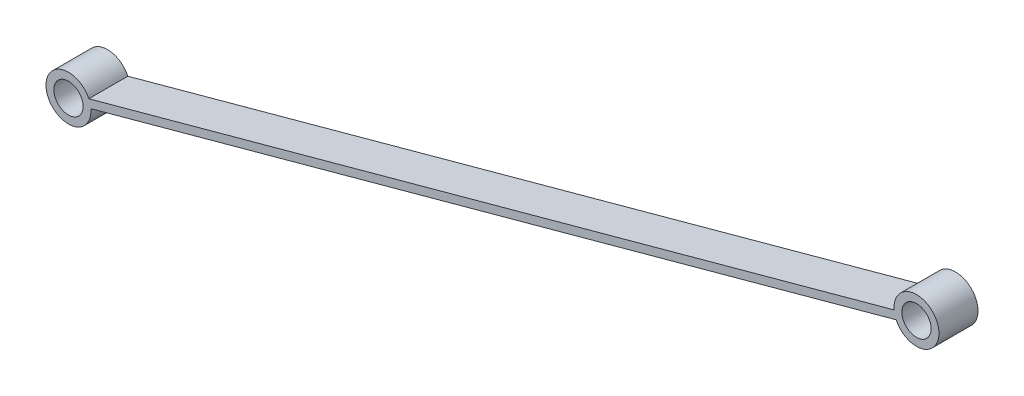
ISO-10303-21;
HEADER;
FILE_DESCRIPTION(('STEP AP214'),'2;1');
FILE_NAME('part.step','',(''),(''),'','','');
FILE_SCHEMA(('AUTOMOTIVE_DESIGN { 1 0 10303 214 1 1 1 1 }'));
ENDSEC;
DATA;
#1=APPLICATION_CONTEXT('core data for automotive mechanical design processes');
#2=APPLICATION_PROTOCOL_DEFINITION('international standard','automotive_design',2000,#1);
#3=PRODUCT_CONTEXT('',#1,'mechanical');
#4=PRODUCT('Part','Part','',(#3));
#5=PRODUCT_RELATED_PRODUCT_CATEGORY('part','',(#4));
#6=PRODUCT_DEFINITION_FORMATION('','',#4);
#7=PRODUCT_DEFINITION_CONTEXT('part definition',#1,'design');
#8=PRODUCT_DEFINITION('design','',#6,#7);
#9=PRODUCT_DEFINITION_SHAPE('','',#8);
#10=(LENGTH_UNIT() NAMED_UNIT(*) SI_UNIT(.MILLI.,.METRE.));
#11=(NAMED_UNIT(*) PLANE_ANGLE_UNIT() SI_UNIT($,.RADIAN.));
#12=(NAMED_UNIT(*) SI_UNIT($,.STERADIAN.) SOLID_ANGLE_UNIT());
#13=UNCERTAINTY_MEASURE_WITH_UNIT(LENGTH_MEASURE(1.E-05),#10,'distance_accuracy_value','');
#14=(GEOMETRIC_REPRESENTATION_CONTEXT(3) GLOBAL_UNCERTAINTY_ASSIGNED_CONTEXT((#13)) GLOBAL_UNIT_ASSIGNED_CONTEXT((#10,
#11,#12)) REPRESENTATION_CONTEXT('',''));
#15=CARTESIAN_POINT('',(0.,0.,0.));
#16=DIRECTION('',(0.,0.,1.));
#17=DIRECTION('',(1.,0.,0.));
#18=AXIS2_PLACEMENT_3D('',#15,#16,#17);
#19=CARTESIAN_POINT('',(-163.126236957769,-95.5245066159686,-10.));
#20=DIRECTION('',(0.,0.,1.));
#21=DIRECTION('',(1.,0.,0.));
#22=AXIS2_PLACEMENT_3D('',#19,#20,#21);
#23=CYLINDRICAL_SURFACE('',#22,3.75);
#24=CARTESIAN_POINT('',(-163.126236957769,-95.5245066159686,0.));
#25=DIRECTION('',(0.,0.,1.));
#26=DIRECTION('',(1.,0.,0.));
#27=AXIS2_PLACEMENT_3D('',#24,#25,#26);
#28=CIRCLE('',#27,3.75);
#29=CARTESIAN_POINT('',(-159.376236957769,-95.5245066159686,0.));
#30=VERTEX_POINT('',#29);
#31=EDGE_CURVE('E11',#30,#30,#28,.T.);
#32=ORIENTED_EDGE('',*,*,#31,.T.);
#33=EDGE_LOOP('',(#32));
#34=FACE_BOUND('',#33,.T.);
#35=CARTESIAN_POINT('',(-163.126236957769,-95.5245066159686,-10.));
#36=DIRECTION('',(0.,0.,1.));
#37=DIRECTION('',(1.,0.,0.));
#38=AXIS2_PLACEMENT_3D('',#35,#36,#37);
#39=CIRCLE('',#38,3.75);
#40=CARTESIAN_POINT('',(-159.376236957769,-95.5245066159686,-10.));
#41=VERTEX_POINT('',#40);
#42=EDGE_CURVE('E39',#41,#41,#39,.T.);
#43=ORIENTED_EDGE('',*,*,#42,.F.);
#44=EDGE_LOOP('',(#43));
#45=FACE_BOUND('',#44,.T.);
#46=ADVANCED_FACE('F35',(#34,#45),#23,.F.);
#47=CARTESIAN_POINT('',(50.1836205093611,-36.2659749585989,-10.));
#48=DIRECTION('',(-0.263313290222035,0.964710376845013,0.));
#49=DIRECTION('',(-0.964710376845013,-0.263313290222035,0.));
#50=AXIS2_PLACEMENT_3D('',#47,#48,#49);
#51=PLANE('',#50);
#52=DIRECTION('',(0.,0.,-1.));
#53=VECTOR('',#52,1.);
#54=CARTESIAN_POINT('',(-157.926997530615,-93.0688174297865,0.));
#55=LINE('',#54,#53);
#56=CARTESIAN_POINT('',(-157.926997530615,-93.0688174297865,0.));
#57=VERTEX_POINT('',#56);
#58=CARTESIAN_POINT('',(-157.926997530615,-93.0688174297865,-10.));
#59=VERTEX_POINT('',#58);
#60=EDGE_CURVE('E56',#57,#59,#55,.T.);
#61=ORIENTED_EDGE('',*,*,#60,.F.);
#62=DIRECTION('',(-0.964710376845013,-0.263313290222035,0.));
#63=VECTOR('',#62,1.);
#64=CARTESIAN_POINT('',(50.1836205093611,-36.2659749585989,0.));
#65=LINE('',#64,#63);
#66=CARTESIAN_POINT('',(48.2077318247612,-36.8052847485029,0.));
#67=VERTEX_POINT('',#66);
#68=EDGE_CURVE('E44',#67,#57,#65,.T.);
#69=ORIENTED_EDGE('',*,*,#68,.F.);
#70=DIRECTION('',(0.,0.,-1.));
#71=VECTOR('',#70,1.);
#72=CARTESIAN_POINT('',(48.2077318247612,-36.8052847485029,0.));
#73=LINE('',#72,#71);
#74=CARTESIAN_POINT('',(48.2077318247612,-36.8052847485029,-10.));
#75=VERTEX_POINT('',#74);
#76=EDGE_CURVE('E105',#75,#67,#73,.F.);
#77=ORIENTED_EDGE('',*,*,#76,.F.);
#78=DIRECTION('',(-0.964710376845013,-0.263313290222035,0.));
#79=VECTOR('',#78,1.);
#80=CARTESIAN_POINT('',(50.1836205093611,-36.2659749585989,-10.));
#81=LINE('',#80,#79);
#82=EDGE_CURVE('E52',#75,#59,#81,.T.);
#83=ORIENTED_EDGE('',*,*,#82,.T.);
#84=EDGE_LOOP('',(#61,#69,#77,#83));
#85=FACE_BOUND('',#84,.T.);
#86=ADVANCED_FACE('F118',(#85),#51,.T.);
#87=CARTESIAN_POINT('',(53.9335978323588,-36.2790163160108,-10.));
#88=DIRECTION('',(0.,0.,1.));
#89=DIRECTION('',(1.,0.,0.));
#90=AXIS2_PLACEMENT_3D('',#87,#88,#89);
#91=CYLINDRICAL_SURFACE('',#90,3.75);
#92=CARTESIAN_POINT('',(53.9335978323588,-36.2790163160108,0.));
#93=DIRECTION('',(0.,0.,1.));
#94=DIRECTION('',(1.,0.,0.));
#95=AXIS2_PLACEMENT_3D('',#92,#93,#94);
#96=CIRCLE('',#95,3.75);
#97=CARTESIAN_POINT('',(57.6835978323588,-36.2790163160108,0.));
#98=VERTEX_POINT('',#97);
#99=EDGE_CURVE('E99',#98,#98,#96,.T.);
#100=ORIENTED_EDGE('',*,*,#99,.T.);
#101=EDGE_LOOP('',(#100));
#102=FACE_BOUND('',#101,.T.);
#103=CARTESIAN_POINT('',(53.9335978323588,-36.2790163160108,-10.));
#104=DIRECTION('',(0.,0.,1.));
#105=DIRECTION('',(1.,0.,0.));
#106=AXIS2_PLACEMENT_3D('',#103,#104,#105);
#107=CIRCLE('',#106,3.75);
#108=CARTESIAN_POINT('',(57.6835978323588,-36.2790163160108,-10.));
#109=VERTEX_POINT('',#108);
#110=EDGE_CURVE('E111',#109,#109,#107,.T.);
#111=ORIENTED_EDGE('',*,*,#110,.F.);
#112=EDGE_LOOP('',(#111));
#113=FACE_BOUND('',#112,.T.);
#114=ADVANCED_FACE('F116',(#102,#113),#91,.F.);
#115=CARTESIAN_POINT('',(-159.376259634771,-95.5375479733805,-10.));
#116=DIRECTION('',(0.263313290222034,-0.964710376845013,0.));
#117=DIRECTION('',(0.964710376845013,0.263313290222034,0.));
#118=AXIS2_PLACEMENT_3D('',#115,#116,#117);
#119=PLANE('',#118);
#120=DIRECTION('',(0.,0.,-1.));
#121=VECTOR('',#120,1.);
#122=CARTESIAN_POINT('',(-157.400370950171,-94.9982381834764,0.));
#123=LINE('',#122,#121);
#124=CARTESIAN_POINT('',(-157.400370950171,-94.9982381834764,-10.));
#125=VERTEX_POINT('',#124);
#126=CARTESIAN_POINT('',(-157.400370950171,-94.9982381834764,0.));
#127=VERTEX_POINT('',#126);
#128=EDGE_CURVE('E78',#125,#127,#123,.F.);
#129=ORIENTED_EDGE('',*,*,#128,.F.);
#130=DIRECTION('',(0.964710376845013,0.263313290222034,0.));
#131=VECTOR('',#130,1.);
#132=CARTESIAN_POINT('',(-159.376259634771,-95.5375479733805,-10.));
#133=LINE('',#132,#131);
#134=CARTESIAN_POINT('',(48.7343584052052,-38.7347055021929,-10.));
#135=VERTEX_POINT('',#134);
#136=EDGE_CURVE('E109',#125,#135,#133,.T.);
#137=ORIENTED_EDGE('',*,*,#136,.T.);
#138=DIRECTION('',(0.,0.,-1.));
#139=VECTOR('',#138,1.);
#140=CARTESIAN_POINT('',(48.7343584052052,-38.7347055021929,0.));
#141=LINE('',#140,#139);
#142=CARTESIAN_POINT('',(48.7343584052052,-38.7347055021929,0.));
#143=VERTEX_POINT('',#142);
#144=EDGE_CURVE('E97',#143,#135,#141,.T.);
#145=ORIENTED_EDGE('',*,*,#144,.F.);
#146=DIRECTION('',(0.964710376845013,0.263313290222034,0.));
#147=VECTOR('',#146,1.);
#148=CARTESIAN_POINT('',(-159.376259634771,-95.5375479733805,0.));
#149=LINE('',#148,#147);
#150=EDGE_CURVE('E92',#127,#143,#149,.T.);
#151=ORIENTED_EDGE('',*,*,#150,.F.);
#152=EDGE_LOOP('',(#129,#137,#145,#151));
#153=FACE_BOUND('',#152,.T.);
#154=ADVANCED_FACE('F95',(#153),#119,.T.);
#155=CARTESIAN_POINT('',(-163.126236957769,-95.5245066159686,-10.));
#156=DIRECTION('',(0.,0.,1.));
#157=DIRECTION('',(1.,0.,0.));
#158=AXIS2_PLACEMENT_3D('',#155,#156,#157);
#159=PLANE('',#158);
#160=ORIENTED_EDGE('',*,*,#42,.T.);
#161=EDGE_LOOP('',(#160));
#162=FACE_BOUND('',#161,.T.);
#163=ORIENTED_EDGE('',*,*,#136,.F.);
#164=CARTESIAN_POINT('',(-163.126236957769,-95.5245066159686,-10.));
#165=DIRECTION('',(0.,0.,-1.));
#166=DIRECTION('',(-1.,0.,0.));
#167=AXIS2_PLACEMENT_3D('',#164,#165,#166);
#168=CIRCLE('',#167,5.75);
#169=EDGE_CURVE('E83',#125,#59,#168,.T.);
#170=ORIENTED_EDGE('',*,*,#169,.T.);
#171=ORIENTED_EDGE('',*,*,#82,.F.);
#172=CARTESIAN_POINT('',(53.9335978323588,-36.2790163160108,-10.));
#173=DIRECTION('',(0.,0.,-1.));
#174=DIRECTION('',(-1.,0.,0.));
#175=AXIS2_PLACEMENT_3D('',#172,#173,#174);
#176=CIRCLE('',#175,5.74999999999999);
#177=EDGE_CURVE('E208',#75,#135,#176,.T.);
#178=ORIENTED_EDGE('',*,*,#177,.T.);
#179=EDGE_LOOP('',(#163,#170,#171,#178));
#180=FACE_BOUND('',#179,.T.);
#181=ORIENTED_EDGE('',*,*,#110,.T.);
#182=EDGE_LOOP('',(#181));
#183=FACE_BOUND('',#182,.T.);
#184=ADVANCED_FACE('F37',(#162,#180,#183),#159,.F.);
#185=CARTESIAN_POINT('',(-163.126236957769,-95.5245066159686,0.));
#186=DIRECTION('',(0.,0.,1.));
#187=DIRECTION('',(1.,0.,0.));
#188=AXIS2_PLACEMENT_3D('',#185,#186,#187);
#189=PLANE('',#188);
#190=ORIENTED_EDGE('',*,*,#31,.F.);
#191=EDGE_LOOP('',(#190));
#192=FACE_BOUND('',#191,.T.);
#193=ORIENTED_EDGE('',*,*,#68,.T.);
#194=CARTESIAN_POINT('',(-163.126236957769,-95.5245066159686,0.));
#195=DIRECTION('',(0.,0.,-1.));
#196=DIRECTION('',(-1.,0.,0.));
#197=AXIS2_PLACEMENT_3D('',#194,#195,#196);
#198=CIRCLE('',#197,5.75);
#199=EDGE_CURVE('E81',#127,#57,#198,.T.);
#200=ORIENTED_EDGE('',*,*,#199,.F.);
#201=ORIENTED_EDGE('',*,*,#150,.T.);
#202=CARTESIAN_POINT('',(53.9335978323588,-36.2790163160108,0.));
#203=DIRECTION('',(0.,0.,-1.));
#204=DIRECTION('',(-1.,0.,0.));
#205=AXIS2_PLACEMENT_3D('',#202,#203,#204);
#206=CIRCLE('',#205,5.74999999999999);
#207=EDGE_CURVE('E209',#67,#143,#206,.T.);
#208=ORIENTED_EDGE('',*,*,#207,.F.);
#209=EDGE_LOOP('',(#193,#200,#201,#208));
#210=FACE_BOUND('',#209,.T.);
#211=ORIENTED_EDGE('',*,*,#99,.F.);
#212=EDGE_LOOP('',(#211));
#213=FACE_BOUND('',#212,.T.);
#214=ADVANCED_FACE('F89',(#192,#210,#213),#189,.T.);
#215=CARTESIAN_POINT('',(53.9335978323588,-36.2790163160108,0.));
#216=DIRECTION('',(0.,0.,-1.));
#217=DIRECTION('',(-1.,0.,0.));
#218=AXIS2_PLACEMENT_3D('',#215,#216,#217);
#219=CYLINDRICAL_SURFACE('',#218,5.74999999999999);
#220=ORIENTED_EDGE('',*,*,#177,.F.);
#221=ORIENTED_EDGE('',*,*,#76,.T.);
#222=ORIENTED_EDGE('',*,*,#207,.T.);
#223=ORIENTED_EDGE('',*,*,#144,.T.);
#224=EDGE_LOOP('',(#220,#221,#222,#223));
#225=FACE_BOUND('',#224,.T.);
#226=ADVANCED_FACE('F136',(#225),#219,.T.);
#227=CARTESIAN_POINT('',(-163.126236957769,-95.5245066159686,0.));
#228=DIRECTION('',(0.,0.,-1.));
#229=DIRECTION('',(-1.,0.,0.));
#230=AXIS2_PLACEMENT_3D('',#227,#228,#229);
#231=CYLINDRICAL_SURFACE('',#230,5.75);
#232=ORIENTED_EDGE('',*,*,#199,.T.);
#233=ORIENTED_EDGE('',*,*,#60,.T.);
#234=ORIENTED_EDGE('',*,*,#169,.F.);
#235=ORIENTED_EDGE('',*,*,#128,.T.);
#236=EDGE_LOOP('',(#232,#233,#234,#235));
#237=FACE_BOUND('',#236,.T.);
#238=ADVANCED_FACE('F80',(#237),#231,.T.);
#239=CLOSED_SHELL('',(#46,#86,#114,#154,#184,#214,#226,#238));
#240=MANIFOLD_SOLID_BREP('B2',#239);
#241=ADVANCED_BREP_SHAPE_REPRESENTATION('',(#18,#240),#14);
#242=SHAPE_DEFINITION_REPRESENTATION(#9,#241);
ENDSEC;
END-ISO-10303-21;
